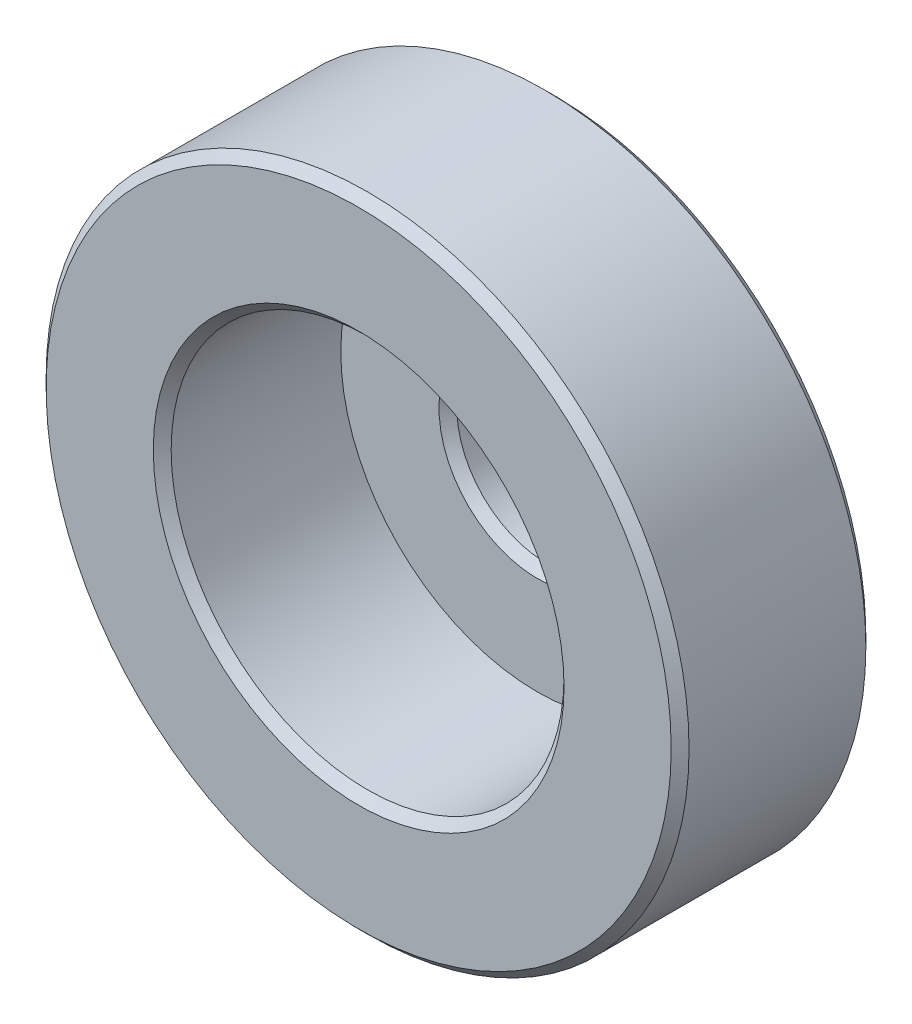
ISO-10303-21;
HEADER;
FILE_DESCRIPTION(('STEP AP214'),'2;1');
FILE_NAME('part.step','',(''),(''),'','','');
FILE_SCHEMA(('AUTOMOTIVE_DESIGN { 1 0 10303 214 1 1 1 1 }'));
ENDSEC;
DATA;
#1=APPLICATION_CONTEXT('core data for automotive mechanical design processes');
#2=APPLICATION_PROTOCOL_DEFINITION('international standard','automotive_design',2000,#1);
#3=PRODUCT_CONTEXT('',#1,'mechanical');
#4=PRODUCT('Part','Part','',(#3));
#5=PRODUCT_RELATED_PRODUCT_CATEGORY('part','',(#4));
#6=PRODUCT_DEFINITION_FORMATION('','',#4);
#7=PRODUCT_DEFINITION_CONTEXT('part definition',#1,'design');
#8=PRODUCT_DEFINITION('design','',#6,#7);
#9=PRODUCT_DEFINITION_SHAPE('','',#8);
#10=(LENGTH_UNIT() NAMED_UNIT(*) SI_UNIT(.MILLI.,.METRE.));
#11=(NAMED_UNIT(*) PLANE_ANGLE_UNIT() SI_UNIT($,.RADIAN.));
#12=(NAMED_UNIT(*) SI_UNIT($,.STERADIAN.) SOLID_ANGLE_UNIT());
#13=UNCERTAINTY_MEASURE_WITH_UNIT(LENGTH_MEASURE(1.E-05),#10,'distance_accuracy_value','');
#14=(GEOMETRIC_REPRESENTATION_CONTEXT(3) GLOBAL_UNCERTAINTY_ASSIGNED_CONTEXT((#13)) GLOBAL_UNIT_ASSIGNED_CONTEXT((#10,
#11,#12)) REPRESENTATION_CONTEXT('',''));
#15=CARTESIAN_POINT('',(0.,0.,0.));
#16=DIRECTION('',(0.,0.,1.));
#17=DIRECTION('',(1.,0.,0.));
#18=AXIS2_PLACEMENT_3D('',#15,#16,#17);
#19=CARTESIAN_POINT('',(-11.,0.,0.));
#20=DIRECTION('',(0.,0.,-1.));
#21=DIRECTION('',(-1.,0.,0.));
#22=AXIS2_PLACEMENT_3D('',#19,#20,#21);
#23=PLANE('',#22);
#24=DIRECTION('',(0.,1.,0.));
#25=VECTOR('',#24,1.);
#26=CARTESIAN_POINT('',(-1.25,-4.84122918275927,0.));
#27=LINE('',#26,#25);
#28=CARTESIAN_POINT('',(-1.25,-10.4253297309965,0.));
#29=VERTEX_POINT('',#28);
#30=CARTESIAN_POINT('',(-1.25,-4.84122918275927,0.));
#31=VERTEX_POINT('',#30);
#32=EDGE_CURVE('E132',#29,#31,#27,.T.);
#33=ORIENTED_EDGE('',*,*,#32,.F.);
#34=CARTESIAN_POINT('',(0.,0.,0.));
#35=DIRECTION('',(0.,0.,-1.));
#36=DIRECTION('',(-1.,0.,0.));
#37=AXIS2_PLACEMENT_3D('',#34,#35,#36);
#38=CIRCLE('',#37,10.5);
#39=CARTESIAN_POINT('',(-1.25,10.4253297309965,0.));
#40=VERTEX_POINT('',#39);
#41=EDGE_CURVE('E208',#29,#40,#38,.T.);
#42=ORIENTED_EDGE('',*,*,#41,.T.);
#43=DIRECTION('',(0.,1.,0.));
#44=VECTOR('',#43,1.);
#45=CARTESIAN_POINT('',(-1.25,10.9409689664164,0.));
#46=LINE('',#45,#44);
#47=CARTESIAN_POINT('',(-1.25,4.84122918275927,0.));
#48=VERTEX_POINT('',#47);
#49=EDGE_CURVE('E141',#48,#40,#46,.T.);
#50=ORIENTED_EDGE('',*,*,#49,.F.);
#51=CARTESIAN_POINT('',(0.,0.,0.));
#52=DIRECTION('',(0.,0.,-1.));
#53=DIRECTION('',(-1.,0.,0.));
#54=AXIS2_PLACEMENT_3D('',#51,#52,#53);
#55=CIRCLE('',#54,5.);
#56=EDGE_CURVE('E166',#31,#48,#55,.T.);
#57=ORIENTED_EDGE('',*,*,#56,.F.);
#58=EDGE_LOOP('',(#33,#42,#50,#57));
#59=FACE_BOUND('',#58,.T.);
#60=ADVANCED_FACE('F32',(#59),#23,.T.);
#61=CARTESIAN_POINT('',(-18.,0.,15.4));
#62=DIRECTION('',(0.,0.,1.));
#63=DIRECTION('',(1.,0.,0.));
#64=AXIS2_PLACEMENT_3D('',#61,#62,#63);
#65=PLANE('',#64);
#66=CARTESIAN_POINT('',(0.,0.,15.4));
#67=DIRECTION('',(0.,0.,1.));
#68=DIRECTION('',(1.,0.,0.));
#69=AXIS2_PLACEMENT_3D('',#66,#67,#68);
#70=CIRCLE('',#69,11.5);
#71=CARTESIAN_POINT('',(11.5,0.,15.4));
#72=VERTEX_POINT('',#71);
#73=EDGE_CURVE('E193',#72,#72,#70,.F.);
#74=ORIENTED_EDGE('',*,*,#73,.T.);
#75=EDGE_LOOP('',(#74));
#76=FACE_BOUND('',#75,.T.);
#77=CARTESIAN_POINT('',(0.,0.,15.4));
#78=DIRECTION('',(0.,0.,1.));
#79=DIRECTION('',(1.,0.,0.));
#80=AXIS2_PLACEMENT_3D('',#77,#78,#79);
#81=CIRCLE('',#80,17.5);
#82=CARTESIAN_POINT('',(17.5,0.,15.4));
#83=VERTEX_POINT('',#82);
#84=EDGE_CURVE('E190',#83,#83,#81,.T.);
#85=ORIENTED_EDGE('',*,*,#84,.T.);
#86=EDGE_LOOP('',(#85));
#87=FACE_BOUND('',#86,.T.);
#88=ADVANCED_FACE('F257',(#76,#87),#65,.T.);
#89=CARTESIAN_POINT('',(0.,0.,0.));
#90=DIRECTION('',(0.,0.,-1.));
#91=DIRECTION('',(-1.,0.,0.));
#92=AXIS2_PLACEMENT_3D('',#89,#90,#91);
#93=CYLINDRICAL_SURFACE('',#92,11.);
#94=CARTESIAN_POINT('',(0.,0.,14.9));
#95=DIRECTION('',(0.,0.,1.));
#96=DIRECTION('',(1.,0.,0.));
#97=AXIS2_PLACEMENT_3D('',#94,#95,#96);
#98=CIRCLE('',#97,11.);
#99=CARTESIAN_POINT('',(11.,0.,14.9));
#100=VERTEX_POINT('',#99);
#101=EDGE_CURVE('E196',#100,#100,#98,.T.);
#102=ORIENTED_EDGE('',*,*,#101,.T.);
#103=EDGE_LOOP('',(#102));
#104=FACE_BOUND('',#103,.T.);
#105=CARTESIAN_POINT('',(0.,0.,5.4));
#106=DIRECTION('',(0.,0.,-1.));
#107=DIRECTION('',(-1.,0.,0.));
#108=AXIS2_PLACEMENT_3D('',#105,#106,#107);
#109=CIRCLE('',#108,11.);
#110=CARTESIAN_POINT('',(-11.,0.,5.4));
#111=VERTEX_POINT('',#110);
#112=EDGE_CURVE('E168',#111,#111,#109,.T.);
#113=ORIENTED_EDGE('',*,*,#112,.T.);
#114=EDGE_LOOP('',(#113));
#115=FACE_BOUND('',#114,.T.);
#116=ADVANCED_FACE('F253',(#104,#115),#93,.F.);
#117=CARTESIAN_POINT('',(-11.,0.,5.4));
#118=DIRECTION('',(0.,0.,1.));
#119=DIRECTION('',(1.,0.,0.));
#120=AXIS2_PLACEMENT_3D('',#117,#118,#119);
#121=PLANE('',#120);
#122=CARTESIAN_POINT('',(0.,0.,5.4));
#123=DIRECTION('',(0.,0.,1.));
#124=DIRECTION('',(1.,0.,0.));
#125=AXIS2_PLACEMENT_3D('',#122,#123,#124);
#126=CIRCLE('',#125,5.49999999999998);
#127=CARTESIAN_POINT('',(5.49999999999999,0.,5.4));
#128=VERTEX_POINT('',#127);
#129=EDGE_CURVE('E184',#128,#128,#126,.F.);
#130=ORIENTED_EDGE('',*,*,#129,.T.);
#131=EDGE_LOOP('',(#130));
#132=FACE_BOUND('',#131,.T.);
#133=ORIENTED_EDGE('',*,*,#112,.F.);
#134=EDGE_LOOP('',(#133));
#135=FACE_BOUND('',#134,.T.);
#136=ADVANCED_FACE('F249',(#132,#135),#121,.T.);
#137=CARTESIAN_POINT('',(0.,0.,0.));
#138=DIRECTION('',(0.,0.,-1.));
#139=DIRECTION('',(-1.,0.,0.));
#140=AXIS2_PLACEMENT_3D('',#137,#138,#139);
#141=CYLINDRICAL_SURFACE('',#140,5.);
#142=CARTESIAN_POINT('',(0.,0.,4.90000000000001));
#143=DIRECTION('',(0.,0.,1.));
#144=DIRECTION('',(1.,0.,0.));
#145=AXIS2_PLACEMENT_3D('',#142,#143,#144);
#146=CIRCLE('',#145,5.);
#147=CARTESIAN_POINT('',(5.,0.,4.90000000000001));
#148=VERTEX_POINT('',#147);
#149=EDGE_CURVE('E187',#148,#148,#146,.T.);
#150=ORIENTED_EDGE('',*,*,#149,.T.);
#151=EDGE_LOOP('',(#150));
#152=FACE_BOUND('',#151,.T.);
#153=DIRECTION('',(0.,0.,-1.));
#154=VECTOR('',#153,1.);
#155=CARTESIAN_POINT('',(-1.25,-4.84122918275927,1.5));
#156=LINE('',#155,#154);
#157=CARTESIAN_POINT('',(-1.25,-4.84122918275927,1.5));
#158=VERTEX_POINT('',#157);
#159=EDGE_CURVE('E139',#158,#31,#156,.T.);
#160=ORIENTED_EDGE('',*,*,#159,.T.);
#161=ORIENTED_EDGE('',*,*,#56,.T.);
#162=DIRECTION('',(0.,0.,-1.));
#163=VECTOR('',#162,1.);
#164=CARTESIAN_POINT('',(-1.25,4.84122918275927,1.5));
#165=LINE('',#164,#163);
#166=CARTESIAN_POINT('',(-1.25,4.84122918275927,1.5));
#167=VERTEX_POINT('',#166);
#168=EDGE_CURVE('E155',#167,#48,#165,.T.);
#169=ORIENTED_EDGE('',*,*,#168,.F.);
#170=CARTESIAN_POINT('',(0.,0.,1.5));
#171=DIRECTION('',(0.,0.,1.));
#172=DIRECTION('',(-1.,0.,0.));
#173=AXIS2_PLACEMENT_3D('',#170,#171,#172);
#174=CIRCLE('',#173,5.);
#175=CARTESIAN_POINT('',(1.25,4.84122918275927,1.5));
#176=VERTEX_POINT('',#175);
#177=EDGE_CURVE('E146',#176,#167,#174,.T.);
#178=ORIENTED_EDGE('',*,*,#177,.F.);
#179=DIRECTION('',(0.,0.,-1.));
#180=VECTOR('',#179,1.);
#181=CARTESIAN_POINT('',(1.25,4.84122918275927,1.5));
#182=LINE('',#181,#180);
#183=CARTESIAN_POINT('',(1.25,4.84122918275927,0.));
#184=VERTEX_POINT('',#183);
#185=EDGE_CURVE('E159',#176,#184,#182,.T.);
#186=ORIENTED_EDGE('',*,*,#185,.T.);
#187=CARTESIAN_POINT('',(1.25,-4.84122918275927,0.));
#188=VERTEX_POINT('',#187);
#189=EDGE_CURVE('E138',#184,#188,#55,.T.);
#190=ORIENTED_EDGE('',*,*,#189,.T.);
#191=DIRECTION('',(0.,0.,-1.));
#192=VECTOR('',#191,1.);
#193=CARTESIAN_POINT('',(1.25,-4.84122918275927,1.5));
#194=LINE('',#193,#192);
#195=CARTESIAN_POINT('',(1.25,-4.84122918275927,1.5));
#196=VERTEX_POINT('',#195);
#197=EDGE_CURVE('E117',#196,#188,#194,.T.);
#198=ORIENTED_EDGE('',*,*,#197,.F.);
#199=CARTESIAN_POINT('',(0.,0.,1.5));
#200=DIRECTION('',(0.,0.,1.));
#201=DIRECTION('',(-1.,0.,0.));
#202=AXIS2_PLACEMENT_3D('',#199,#200,#201);
#203=CIRCLE('',#202,5.);
#204=EDGE_CURVE('E124',#158,#196,#203,.T.);
#205=ORIENTED_EDGE('',*,*,#204,.F.);
#206=EDGE_LOOP('',(#160,#161,#169,#178,#186,#190,#198,#205));
#207=FACE_BOUND('',#206,.T.);
#208=ADVANCED_FACE('F135',(#152,#207),#141,.F.);
#209=DIRECTION('',(0.,-1.,0.));
#210=VECTOR('',#209,1.);
#211=CARTESIAN_POINT('',(1.25,10.9409689664164,0.));
#212=LINE('',#211,#210);
#213=CARTESIAN_POINT('',(1.25,10.4253297309965,0.));
#214=VERTEX_POINT('',#213);
#215=EDGE_CURVE('E150',#214,#184,#212,.T.);
#216=ORIENTED_EDGE('',*,*,#215,.F.);
#217=CARTESIAN_POINT('',(0.,0.,0.));
#218=DIRECTION('',(0.,0.,-1.));
#219=DIRECTION('',(-1.,0.,0.));
#220=AXIS2_PLACEMENT_3D('',#217,#218,#219);
#221=CIRCLE('',#220,10.5);
#222=CARTESIAN_POINT('',(1.25,-10.4253297309965,0.));
#223=VERTEX_POINT('',#222);
#224=EDGE_CURVE('E306',#214,#223,#221,.T.);
#225=ORIENTED_EDGE('',*,*,#224,.T.);
#226=DIRECTION('',(0.,-1.,0.));
#227=VECTOR('',#226,1.);
#228=CARTESIAN_POINT('',(1.25,-4.84122918275927,0.));
#229=LINE('',#228,#227);
#230=EDGE_CURVE('E291',#188,#223,#229,.T.);
#231=ORIENTED_EDGE('',*,*,#230,.F.);
#232=ORIENTED_EDGE('',*,*,#189,.F.);
#233=EDGE_LOOP('',(#216,#225,#231,#232));
#234=FACE_BOUND('',#233,.T.);
#235=ADVANCED_FACE('F242',(#234),#23,.T.);
#236=CARTESIAN_POINT('',(0.,0.,0.));
#237=DIRECTION('',(0.,0.,-1.));
#238=DIRECTION('',(-1.,0.,0.));
#239=AXIS2_PLACEMENT_3D('',#236,#237,#238);
#240=CYLINDRICAL_SURFACE('',#239,11.);
#241=DIRECTION('',(0.,0.,-1.));
#242=VECTOR('',#241,1.);
#243=CARTESIAN_POINT('',(-1.25,10.9287464971972,0.));
#244=LINE('',#243,#242);
#245=CARTESIAN_POINT('',(-1.25,10.9287464971972,0.499999999999997));
#246=VERTEX_POINT('',#245);
#247=CARTESIAN_POINT('',(-1.25,10.9287464971972,1.5));
#248=VERTEX_POINT('',#247);
#249=EDGE_CURVE('E174',#246,#248,#244,.F.);
#250=ORIENTED_EDGE('',*,*,#249,.F.);
#251=CARTESIAN_POINT('',(0.,0.,0.499999999999997));
#252=DIRECTION('',(0.,0.,-1.));
#253=DIRECTION('',(-1.,0.,0.));
#254=AXIS2_PLACEMENT_3D('',#251,#252,#253);
#255=CIRCLE('',#254,11.);
#256=CARTESIAN_POINT('',(-1.25,-10.9287464971972,0.499999999999997));
#257=VERTEX_POINT('',#256);
#258=EDGE_CURVE('E295',#246,#257,#255,.F.);
#259=ORIENTED_EDGE('',*,*,#258,.T.);
#260=DIRECTION('',(0.,0.,-1.));
#261=VECTOR('',#260,1.);
#262=CARTESIAN_POINT('',(-1.25,-10.9287464971972,0.));
#263=LINE('',#262,#261);
#264=CARTESIAN_POINT('',(-1.25,-10.9287464971972,1.5));
#265=VERTEX_POINT('',#264);
#266=EDGE_CURVE('E181',#265,#257,#263,.T.);
#267=ORIENTED_EDGE('',*,*,#266,.F.);
#268=CARTESIAN_POINT('',(0.,0.,1.5));
#269=DIRECTION('',(0.,0.,-1.));
#270=DIRECTION('',(-1.,0.,0.));
#271=AXIS2_PLACEMENT_3D('',#268,#269,#270);
#272=CIRCLE('',#271,11.);
#273=CARTESIAN_POINT('',(1.25,-10.9287464971972,1.5));
#274=VERTEX_POINT('',#273);
#275=EDGE_CURVE('E178',#265,#274,#272,.F.);
#276=ORIENTED_EDGE('',*,*,#275,.T.);
#277=DIRECTION('',(0.,0.,-1.));
#278=VECTOR('',#277,1.);
#279=CARTESIAN_POINT('',(1.25,-10.9287464971972,0.));
#280=LINE('',#279,#278);
#281=CARTESIAN_POINT('',(1.25,-10.9287464971972,0.5));
#282=VERTEX_POINT('',#281);
#283=EDGE_CURVE('E120',#282,#274,#280,.F.);
#284=ORIENTED_EDGE('',*,*,#283,.F.);
#285=CARTESIAN_POINT('',(0.,0.,0.500000000000001));
#286=DIRECTION('',(0.,0.,-1.));
#287=DIRECTION('',(-1.,0.,0.));
#288=AXIS2_PLACEMENT_3D('',#285,#286,#287);
#289=CIRCLE('',#288,11.);
#290=CARTESIAN_POINT('',(1.25,10.9287464971972,0.5));
#291=VERTEX_POINT('',#290);
#292=EDGE_CURVE('E217',#282,#291,#289,.F.);
#293=ORIENTED_EDGE('',*,*,#292,.T.);
#294=DIRECTION('',(0.,0.,-1.));
#295=VECTOR('',#294,1.);
#296=CARTESIAN_POINT('',(1.25,10.9287464971972,0.));
#297=LINE('',#296,#295);
#298=CARTESIAN_POINT('',(1.25,10.9287464971972,1.5));
#299=VERTEX_POINT('',#298);
#300=EDGE_CURVE('E176',#299,#291,#297,.T.);
#301=ORIENTED_EDGE('',*,*,#300,.F.);
#302=CARTESIAN_POINT('',(0.,0.,1.5));
#303=DIRECTION('',(0.,0.,-1.));
#304=DIRECTION('',(-1.,0.,0.));
#305=AXIS2_PLACEMENT_3D('',#302,#303,#304);
#306=CIRCLE('',#305,11.);
#307=EDGE_CURVE('E171',#299,#248,#306,.F.);
#308=ORIENTED_EDGE('',*,*,#307,.T.);
#309=EDGE_LOOP('',(#250,#259,#267,#276,#284,#293,#301,#308));
#310=FACE_BOUND('',#309,.T.);
#311=CARTESIAN_POINT('',(0.,0.,4.5));
#312=DIRECTION('',(0.,0.,-1.));
#313=DIRECTION('',(-1.,0.,0.));
#314=AXIS2_PLACEMENT_3D('',#311,#312,#313);
#315=CIRCLE('',#314,11.);
#316=CARTESIAN_POINT('',(-11.,0.,4.5));
#317=VERTEX_POINT('',#316);
#318=EDGE_CURVE('E161',#317,#317,#315,.T.);
#319=ORIENTED_EDGE('',*,*,#318,.T.);
#320=EDGE_LOOP('',(#319));
#321=FACE_BOUND('',#320,.T.);
#322=ADVANCED_FACE('F238',(#310,#321),#240,.T.);
#323=CARTESIAN_POINT('',(-18.,0.,4.5));
#324=DIRECTION('',(0.,0.,-1.));
#325=DIRECTION('',(-1.,0.,0.));
#326=AXIS2_PLACEMENT_3D('',#323,#324,#325);
#327=PLANE('',#326);
#328=CARTESIAN_POINT('',(0.,0.,4.5));
#329=DIRECTION('',(0.,0.,-1.));
#330=DIRECTION('',(-1.,0.,0.));
#331=AXIS2_PLACEMENT_3D('',#328,#329,#330);
#332=CIRCLE('',#331,17.5);
#333=CARTESIAN_POINT('',(-17.5,0.,4.5));
#334=VERTEX_POINT('',#333);
#335=EDGE_CURVE('E205',#334,#334,#332,.T.);
#336=ORIENTED_EDGE('',*,*,#335,.T.);
#337=EDGE_LOOP('',(#336));
#338=FACE_BOUND('',#337,.T.);
#339=ORIENTED_EDGE('',*,*,#318,.F.);
#340=EDGE_LOOP('',(#339));
#341=FACE_BOUND('',#340,.T.);
#342=ADVANCED_FACE('F234',(#338,#341),#327,.T.);
#343=CARTESIAN_POINT('',(0.,0.,0.));
#344=DIRECTION('',(0.,0.,-1.));
#345=DIRECTION('',(-1.,0.,0.));
#346=AXIS2_PLACEMENT_3D('',#343,#344,#345);
#347=CYLINDRICAL_SURFACE('',#346,18.);
#348=CARTESIAN_POINT('',(0.,0.,14.9));
#349=DIRECTION('',(0.,0.,1.));
#350=DIRECTION('',(1.,0.,0.));
#351=AXIS2_PLACEMENT_3D('',#348,#349,#350);
#352=CIRCLE('',#351,18.);
#353=CARTESIAN_POINT('',(18.,0.,14.9));
#354=VERTEX_POINT('',#353);
#355=EDGE_CURVE('E202',#354,#354,#352,.F.);
#356=ORIENTED_EDGE('',*,*,#355,.T.);
#357=EDGE_LOOP('',(#356));
#358=FACE_BOUND('',#357,.T.);
#359=CARTESIAN_POINT('',(0.,0.,4.99999999999999));
#360=DIRECTION('',(0.,0.,-1.));
#361=DIRECTION('',(-1.,0.,0.));
#362=AXIS2_PLACEMENT_3D('',#359,#360,#361);
#363=CIRCLE('',#362,18.);
#364=CARTESIAN_POINT('',(-18.,0.,4.99999999999999));
#365=VERTEX_POINT('',#364);
#366=EDGE_CURVE('E199',#365,#365,#363,.F.);
#367=ORIENTED_EDGE('',*,*,#366,.T.);
#368=EDGE_LOOP('',(#367));
#369=FACE_BOUND('',#368,.T.);
#370=ADVANCED_FACE('F231',(#358,#369),#347,.T.);
#371=CARTESIAN_POINT('',(1.25,10.9409689664164,1.5));
#372=DIRECTION('',(1.,0.,0.));
#373=DIRECTION('',(0.,0.,-1.));
#374=AXIS2_PLACEMENT_3D('',#371,#372,#373);
#375=PLANE('',#374);
#376=ORIENTED_EDGE('',*,*,#300,.T.);
#377=CARTESIAN_POINT('',(1.25,10.9287464971972,0.5));
#378=CARTESIAN_POINT('',(1.25,10.8448569910639,0.416653287652448));
#379=CARTESIAN_POINT('',(1.25,10.76096084082,0.333313264818164));
#380=CARTESIAN_POINT('',(1.25,10.5931552520865,0.166646598151493));
#381=CARTESIAN_POINT('',(1.25,10.5092458135968,0.0833199543191108));
#382=CARTESIAN_POINT('',(1.25,10.4253297309965,0.));
#383=B_SPLINE_CURVE_WITH_KNOTS('',3,(#377,#378,#379,#380,#381,#382),.UNSPECIFIED.,.F.,.F.,(4,2,
4),(0.,0.354763457652868,0.709526915410628),.UNSPECIFIED.);
#384=EDGE_CURVE('E11',#291,#214,#383,.T.);
#385=ORIENTED_EDGE('',*,*,#384,.T.);
#386=ORIENTED_EDGE('',*,*,#215,.T.);
#387=ORIENTED_EDGE('',*,*,#185,.F.);
#388=DIRECTION('',(0.,-1.,0.));
#389=VECTOR('',#388,1.);
#390=CARTESIAN_POINT('',(1.25,10.9409689664164,1.5));
#391=LINE('',#390,#389);
#392=EDGE_CURVE('E153',#299,#176,#391,.T.);
#393=ORIENTED_EDGE('',*,*,#392,.F.);
#394=EDGE_LOOP('',(#376,#385,#386,#387,#393));
#395=FACE_BOUND('',#394,.T.);
#396=ADVANCED_FACE('F227',(#395),#375,.F.);
#397=CARTESIAN_POINT('',(-1.25,10.9409689664164,1.5));
#398=DIRECTION('',(-1.,0.,0.));
#399=DIRECTION('',(0.,0.,1.));
#400=AXIS2_PLACEMENT_3D('',#397,#398,#399);
#401=PLANE('',#400);
#402=ORIENTED_EDGE('',*,*,#49,.T.);
#403=CARTESIAN_POINT('',(-1.25,10.4253297309965,0.));
#404=CARTESIAN_POINT('',(-1.25,10.5092458135968,0.0833199543191108));
#405=CARTESIAN_POINT('',(-1.25,10.5931552520865,0.166646598151493));
#406=CARTESIAN_POINT('',(-1.25,10.76096084082,0.333313264818163));
#407=CARTESIAN_POINT('',(-1.25,10.8448569910639,0.416653287652446));
#408=CARTESIAN_POINT('',(-1.25,10.9287464971972,0.499999999999997));
#409=B_SPLINE_CURVE_WITH_KNOTS('',3,(#403,#404,#405,#406,#407,#408),.UNSPECIFIED.,.F.,.F.,(4,2,
4),(0.,0.354763457757757,0.709526915410622),.UNSPECIFIED.);
#410=EDGE_CURVE('E211',#40,#246,#409,.T.);
#411=ORIENTED_EDGE('',*,*,#410,.T.);
#412=ORIENTED_EDGE('',*,*,#249,.T.);
#413=DIRECTION('',(0.,1.,0.));
#414=VECTOR('',#413,1.);
#415=CARTESIAN_POINT('',(-1.25,10.9409689664164,1.5));
#416=LINE('',#415,#414);
#417=EDGE_CURVE('E149',#167,#248,#416,.T.);
#418=ORIENTED_EDGE('',*,*,#417,.F.);
#419=ORIENTED_EDGE('',*,*,#168,.T.);
#420=EDGE_LOOP('',(#402,#411,#412,#418,#419));
#421=FACE_BOUND('',#420,.T.);
#422=ADVANCED_FACE('F222',(#421),#401,.F.);
#423=CARTESIAN_POINT('',(0.,0.,1.5));
#424=DIRECTION('',(0.,0.,-1.));
#425=DIRECTION('',(-1.,0.,0.));
#426=AXIS2_PLACEMENT_3D('',#423,#424,#425);
#427=PLANE('',#426);
#428=ORIENTED_EDGE('',*,*,#392,.T.);
#429=ORIENTED_EDGE('',*,*,#177,.T.);
#430=ORIENTED_EDGE('',*,*,#417,.T.);
#431=ORIENTED_EDGE('',*,*,#307,.F.);
#432=EDGE_LOOP('',(#428,#429,#430,#431));
#433=FACE_BOUND('',#432,.T.);
#434=ADVANCED_FACE('F226',(#433),#427,.T.);
#435=CARTESIAN_POINT('',(-1.25,-4.84122918275927,1.5));
#436=DIRECTION('',(-1.,0.,0.));
#437=DIRECTION('',(0.,0.,1.));
#438=AXIS2_PLACEMENT_3D('',#435,#436,#437);
#439=PLANE('',#438);
#440=ORIENTED_EDGE('',*,*,#266,.T.);
#441=CARTESIAN_POINT('',(-1.25,-10.9287464971972,0.499999999999997));
#442=CARTESIAN_POINT('',(-1.25,-10.8448569910639,0.416653287652446));
#443=CARTESIAN_POINT('',(-1.25,-10.76096084082,0.333313264818162));
#444=CARTESIAN_POINT('',(-1.25,-10.5931552520865,0.166646598151493));
#445=CARTESIAN_POINT('',(-1.25,-10.5092458135968,0.0833199543191116));
#446=CARTESIAN_POINT('',(-1.25,-10.4253297309965,0.));
#447=B_SPLINE_CURVE_WITH_KNOTS('',3,(#441,#442,#443,#444,#445,#446),.UNSPECIFIED.,.F.,.F.,(4,2,
4),(0.,0.354763457652867,0.709526915410622),.UNSPECIFIED.);
#448=EDGE_CURVE('E294',#257,#29,#447,.T.);
#449=ORIENTED_EDGE('',*,*,#448,.T.);
#450=ORIENTED_EDGE('',*,*,#32,.T.);
#451=ORIENTED_EDGE('',*,*,#159,.F.);
#452=DIRECTION('',(0.,1.,0.));
#453=VECTOR('',#452,1.);
#454=CARTESIAN_POINT('',(-1.25,-4.84122918275927,1.5));
#455=LINE('',#454,#453);
#456=EDGE_CURVE('E123',#265,#158,#455,.T.);
#457=ORIENTED_EDGE('',*,*,#456,.F.);
#458=EDGE_LOOP('',(#440,#449,#450,#451,#457));
#459=FACE_BOUND('',#458,.T.);
#460=ADVANCED_FACE('F305',(#459),#439,.F.);
#461=CARTESIAN_POINT('',(1.25,-4.84122918275927,1.5));
#462=DIRECTION('',(1.,0.,0.));
#463=DIRECTION('',(0.,0.,-1.));
#464=AXIS2_PLACEMENT_3D('',#461,#462,#463);
#465=PLANE('',#464);
#466=ORIENTED_EDGE('',*,*,#230,.T.);
#467=CARTESIAN_POINT('',(1.25,-10.4253297309965,0.));
#468=CARTESIAN_POINT('',(1.25,-10.5092458135968,0.0833199543191107));
#469=CARTESIAN_POINT('',(1.25,-10.5931552520865,0.166646598151493));
#470=CARTESIAN_POINT('',(1.25,-10.76096084082,0.333313264818164));
#471=CARTESIAN_POINT('',(1.25,-10.8448569910639,0.416653287652448));
#472=CARTESIAN_POINT('',(1.25,-10.9287464971972,0.5));
#473=B_SPLINE_CURVE_WITH_KNOTS('',3,(#467,#468,#469,#470,#471,#472),.UNSPECIFIED.,.F.,.F.,(4,2,
4),(0.,0.35476345775776,0.709526915410629),.UNSPECIFIED.);
#474=EDGE_CURVE('E45',#223,#282,#473,.T.);
#475=ORIENTED_EDGE('',*,*,#474,.T.);
#476=ORIENTED_EDGE('',*,*,#283,.T.);
#477=DIRECTION('',(0.,-1.,0.));
#478=VECTOR('',#477,1.);
#479=CARTESIAN_POINT('',(1.25,-4.84122918275927,1.5));
#480=LINE('',#479,#478);
#481=EDGE_CURVE('E112',#196,#274,#480,.T.);
#482=ORIENTED_EDGE('',*,*,#481,.F.);
#483=ORIENTED_EDGE('',*,*,#197,.T.);
#484=EDGE_LOOP('',(#466,#475,#476,#482,#483));
#485=FACE_BOUND('',#484,.T.);
#486=ADVANCED_FACE('F115',(#485),#465,.F.);
#487=CARTESIAN_POINT('',(0.,0.,1.5));
#488=DIRECTION('',(0.,0.,-1.));
#489=DIRECTION('',(-1.,0.,0.));
#490=AXIS2_PLACEMENT_3D('',#487,#488,#489);
#491=PLANE('',#490);
#492=ORIENTED_EDGE('',*,*,#456,.T.);
#493=ORIENTED_EDGE('',*,*,#204,.T.);
#494=ORIENTED_EDGE('',*,*,#481,.T.);
#495=ORIENTED_EDGE('',*,*,#275,.F.);
#496=EDGE_LOOP('',(#492,#493,#494,#495));
#497=FACE_BOUND('',#496,.T.);
#498=ADVANCED_FACE('F127',(#497),#491,.T.);
#499=CARTESIAN_POINT('',(0.,0.,5.4));
#500=DIRECTION('',(0.,0.,1.));
#501=DIRECTION('',(1.,0.,0.));
#502=AXIS2_PLACEMENT_3D('',#499,#500,#501);
#503=CONICAL_SURFACE('',#502,5.49999999999998,0.785398163397444);
#504=ORIENTED_EDGE('',*,*,#149,.F.);
#505=EDGE_LOOP('',(#504));
#506=FACE_BOUND('',#505,.T.);
#507=ORIENTED_EDGE('',*,*,#129,.F.);
#508=EDGE_LOOP('',(#507));
#509=FACE_BOUND('',#508,.T.);
#510=ADVANCED_FACE('F262',(#506,#509),#503,.F.);
#511=CARTESIAN_POINT('',(0.,0.,15.4));
#512=DIRECTION('',(0.,0.,1.));
#513=DIRECTION('',(1.,0.,0.));
#514=AXIS2_PLACEMENT_3D('',#511,#512,#513);
#515=CONICAL_SURFACE('',#514,11.5,0.785398163397445);
#516=ORIENTED_EDGE('',*,*,#101,.F.);
#517=EDGE_LOOP('',(#516));
#518=FACE_BOUND('',#517,.T.);
#519=ORIENTED_EDGE('',*,*,#73,.F.);
#520=EDGE_LOOP('',(#519));
#521=FACE_BOUND('',#520,.T.);
#522=ADVANCED_FACE('F265',(#518,#521),#515,.F.);
#523=CARTESIAN_POINT('',(0.,0.,14.9));
#524=DIRECTION('',(0.,0.,-1.));
#525=DIRECTION('',(-1.,0.,0.));
#526=AXIS2_PLACEMENT_3D('',#523,#524,#525);
#527=CONICAL_SURFACE('',#526,18.,0.785398163397452);
#528=ORIENTED_EDGE('',*,*,#84,.F.);
#529=EDGE_LOOP('',(#528));
#530=FACE_BOUND('',#529,.T.);
#531=ORIENTED_EDGE('',*,*,#355,.F.);
#532=EDGE_LOOP('',(#531));
#533=FACE_BOUND('',#532,.T.);
#534=ADVANCED_FACE('F269',(#530,#533),#527,.T.);
#535=CARTESIAN_POINT('',(0.,0.,4.5));
#536=DIRECTION('',(0.,0.,1.));
#537=DIRECTION('',(1.,0.,0.));
#538=AXIS2_PLACEMENT_3D('',#535,#536,#537);
#539=CONICAL_SURFACE('',#538,17.5,0.785398163397452);
#540=ORIENTED_EDGE('',*,*,#366,.F.);
#541=EDGE_LOOP('',(#540));
#542=FACE_BOUND('',#541,.T.);
#543=ORIENTED_EDGE('',*,*,#335,.F.);
#544=EDGE_LOOP('',(#543));
#545=FACE_BOUND('',#544,.T.);
#546=ADVANCED_FACE('F272',(#542,#545),#539,.T.);
#547=CARTESIAN_POINT('',(0.,0.,0.));
#548=DIRECTION('',(0.,0.,1.));
#549=DIRECTION('',(1.,0.,0.));
#550=AXIS2_PLACEMENT_3D('',#547,#548,#549);
#551=CONICAL_SURFACE('',#550,10.5,0.785398163397447);
#552=ORIENTED_EDGE('',*,*,#448,.F.);
#553=ORIENTED_EDGE('',*,*,#258,.F.);
#554=ORIENTED_EDGE('',*,*,#410,.F.);
#555=ORIENTED_EDGE('',*,*,#41,.F.);
#556=EDGE_LOOP('',(#552,#553,#554,#555));
#557=FACE_BOUND('',#556,.T.);
#558=ADVANCED_FACE('F219',(#557),#551,.T.);
#559=CARTESIAN_POINT('',(0.,0.,0.));
#560=DIRECTION('',(0.,0.,1.));
#561=DIRECTION('',(1.,0.,0.));
#562=AXIS2_PLACEMENT_3D('',#559,#560,#561);
#563=CONICAL_SURFACE('',#562,10.5,0.785398163397446);
#564=ORIENTED_EDGE('',*,*,#384,.F.);
#565=ORIENTED_EDGE('',*,*,#292,.F.);
#566=ORIENTED_EDGE('',*,*,#474,.F.);
#567=ORIENTED_EDGE('',*,*,#224,.F.);
#568=EDGE_LOOP('',(#564,#565,#566,#567));
#569=FACE_BOUND('',#568,.T.);
#570=ADVANCED_FACE('F34',(#569),#563,.T.);
#571=CLOSED_SHELL('',(#60,#88,#116,#136,#208,#235,#322,#342,#370,#396,#422,#434,#460,#486,#498,
#510,#522,#534,#546,#558,#570));
#572=MANIFOLD_SOLID_BREP('B2',#571);
#573=ADVANCED_BREP_SHAPE_REPRESENTATION('',(#18,#572),#14);
#574=SHAPE_DEFINITION_REPRESENTATION(#9,#573);
ENDSEC;
END-ISO-10303-21;
